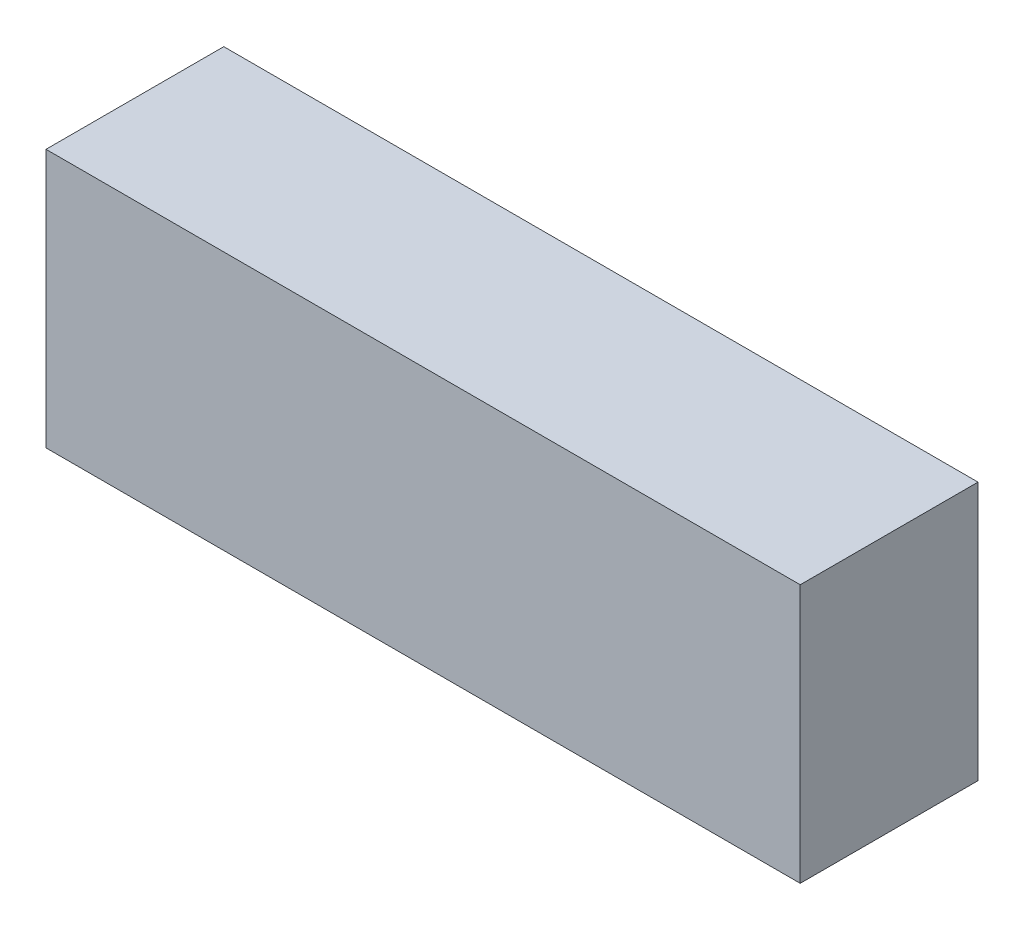
ISO-10303-21;
HEADER;
FILE_DESCRIPTION(('STEP AP214'),'2;1');
FILE_NAME('part.step','',(''),(''),'','','');
FILE_SCHEMA(('AUTOMOTIVE_DESIGN { 1 0 10303 214 1 1 1 1 }'));
ENDSEC;
DATA;
#1=APPLICATION_CONTEXT('core data for automotive mechanical design processes');
#2=APPLICATION_PROTOCOL_DEFINITION('international standard','automotive_design',2000,#1);
#3=PRODUCT_CONTEXT('',#1,'mechanical');
#4=PRODUCT('Part','Part','',(#3));
#5=PRODUCT_RELATED_PRODUCT_CATEGORY('part','',(#4));
#6=PRODUCT_DEFINITION_FORMATION('','',#4);
#7=PRODUCT_DEFINITION_CONTEXT('part definition',#1,'design');
#8=PRODUCT_DEFINITION('design','',#6,#7);
#9=PRODUCT_DEFINITION_SHAPE('','',#8);
#10=(LENGTH_UNIT() NAMED_UNIT(*) SI_UNIT(.MILLI.,.METRE.));
#11=(NAMED_UNIT(*) PLANE_ANGLE_UNIT() SI_UNIT($,.RADIAN.));
#12=(NAMED_UNIT(*) SI_UNIT($,.STERADIAN.) SOLID_ANGLE_UNIT());
#13=UNCERTAINTY_MEASURE_WITH_UNIT(LENGTH_MEASURE(1.E-05),#10,'distance_accuracy_value','');
#14=(GEOMETRIC_REPRESENTATION_CONTEXT(3) GLOBAL_UNCERTAINTY_ASSIGNED_CONTEXT((#13)) GLOBAL_UNIT_ASSIGNED_CONTEXT((#10,
#11,#12)) REPRESENTATION_CONTEXT('',''));
#15=CARTESIAN_POINT('',(0.,0.,0.));
#16=DIRECTION('',(0.,0.,1.));
#17=DIRECTION('',(1.,0.,0.));
#18=AXIS2_PLACEMENT_3D('',#15,#16,#17);
#19=CARTESIAN_POINT('',(44.45,15.24,20.955));
#20=DIRECTION('',(-1.,0.,0.));
#21=DIRECTION('',(0.,-1.,0.));
#22=AXIS2_PLACEMENT_3D('',#19,#20,#21);
#23=PLANE('',#22);
#24=DIRECTION('',(0.,1.,0.));
#25=VECTOR('',#24,1.);
#26=CARTESIAN_POINT('',(44.45,15.24,0.));
#27=LINE('',#26,#25);
#28=CARTESIAN_POINT('',(44.45,-15.24,0.));
#29=VERTEX_POINT('',#28);
#30=CARTESIAN_POINT('',(44.45,15.24,0.));
#31=VERTEX_POINT('',#30);
#32=EDGE_CURVE('E102',#29,#31,#27,.T.);
#33=ORIENTED_EDGE('',*,*,#32,.T.);
#34=DIRECTION('',(0.,0.,-1.));
#35=VECTOR('',#34,1.);
#36=CARTESIAN_POINT('',(44.45,15.24,20.955));
#37=LINE('',#36,#35);
#38=CARTESIAN_POINT('',(44.45,15.24,20.955));
#39=VERTEX_POINT('',#38);
#40=EDGE_CURVE('E11',#39,#31,#37,.T.);
#41=ORIENTED_EDGE('',*,*,#40,.F.);
#42=DIRECTION('',(0.,1.,0.));
#43=VECTOR('',#42,1.);
#44=CARTESIAN_POINT('',(44.45,15.24,20.955));
#45=LINE('',#44,#43);
#46=CARTESIAN_POINT('',(44.45,-15.24,20.955));
#47=VERTEX_POINT('',#46);
#48=EDGE_CURVE('E90',#47,#39,#45,.T.);
#49=ORIENTED_EDGE('',*,*,#48,.F.);
#50=DIRECTION('',(0.,0.,-1.));
#51=VECTOR('',#50,1.);
#52=CARTESIAN_POINT('',(44.45,-15.24,20.955));
#53=LINE('',#52,#51);
#54=EDGE_CURVE('E98',#47,#29,#53,.T.);
#55=ORIENTED_EDGE('',*,*,#54,.T.);
#56=EDGE_LOOP('',(#33,#41,#49,#55));
#57=FACE_BOUND('',#56,.T.);
#58=ADVANCED_FACE('F39',(#57),#23,.F.);
#59=CARTESIAN_POINT('',(-44.45,15.24,20.955));
#60=DIRECTION('',(0.,-1.,0.));
#61=DIRECTION('',(0.,0.,-1.));
#62=AXIS2_PLACEMENT_3D('',#59,#60,#61);
#63=PLANE('',#62);
#64=DIRECTION('',(-1.,0.,0.));
#65=VECTOR('',#64,1.);
#66=CARTESIAN_POINT('',(-44.45,15.24,0.));
#67=LINE('',#66,#65);
#68=CARTESIAN_POINT('',(-44.45,15.24,0.));
#69=VERTEX_POINT('',#68);
#70=EDGE_CURVE('E94',#31,#69,#67,.T.);
#71=ORIENTED_EDGE('',*,*,#70,.T.);
#72=DIRECTION('',(0.,0.,-1.));
#73=VECTOR('',#72,1.);
#74=CARTESIAN_POINT('',(-44.45,15.24,20.955));
#75=LINE('',#74,#73);
#76=CARTESIAN_POINT('',(-44.45,15.24,20.955));
#77=VERTEX_POINT('',#76);
#78=EDGE_CURVE('E47',#77,#69,#75,.T.);
#79=ORIENTED_EDGE('',*,*,#78,.F.);
#80=DIRECTION('',(-1.,0.,0.));
#81=VECTOR('',#80,1.);
#82=CARTESIAN_POINT('',(-44.45,15.24,20.955));
#83=LINE('',#82,#81);
#84=EDGE_CURVE('E85',#39,#77,#83,.T.);
#85=ORIENTED_EDGE('',*,*,#84,.F.);
#86=ORIENTED_EDGE('',*,*,#40,.T.);
#87=EDGE_LOOP('',(#71,#79,#85,#86));
#88=FACE_BOUND('',#87,.T.);
#89=ADVANCED_FACE('F93',(#88),#63,.F.);
#90=CARTESIAN_POINT('',(-44.45,15.24,20.955));
#91=DIRECTION('',(1.,0.,0.));
#92=DIRECTION('',(0.,1.,0.));
#93=AXIS2_PLACEMENT_3D('',#90,#91,#92);
#94=PLANE('',#93);
#95=DIRECTION('',(0.,-1.,0.));
#96=VECTOR('',#95,1.);
#97=CARTESIAN_POINT('',(-44.45,15.24,0.));
#98=LINE('',#97,#96);
#99=CARTESIAN_POINT('',(-44.45,-15.24,0.));
#100=VERTEX_POINT('',#99);
#101=EDGE_CURVE('E72',#69,#100,#98,.T.);
#102=ORIENTED_EDGE('',*,*,#101,.T.);
#103=DIRECTION('',(0.,0.,-1.));
#104=VECTOR('',#103,1.);
#105=CARTESIAN_POINT('',(-44.45,-15.24,20.955));
#106=LINE('',#105,#104);
#107=CARTESIAN_POINT('',(-44.45,-15.24,20.955));
#108=VERTEX_POINT('',#107);
#109=EDGE_CURVE('E95',#108,#100,#106,.T.);
#110=ORIENTED_EDGE('',*,*,#109,.F.);
#111=DIRECTION('',(0.,-1.,0.));
#112=VECTOR('',#111,1.);
#113=CARTESIAN_POINT('',(-44.45,15.24,20.955));
#114=LINE('',#113,#112);
#115=EDGE_CURVE('E88',#77,#108,#114,.T.);
#116=ORIENTED_EDGE('',*,*,#115,.F.);
#117=ORIENTED_EDGE('',*,*,#78,.T.);
#118=EDGE_LOOP('',(#102,#110,#116,#117));
#119=FACE_BOUND('',#118,.T.);
#120=ADVANCED_FACE('F96',(#119),#94,.F.);
#121=CARTESIAN_POINT('',(-44.45,-15.24,20.955));
#122=DIRECTION('',(0.,1.,0.));
#123=DIRECTION('',(0.,0.,1.));
#124=AXIS2_PLACEMENT_3D('',#121,#122,#123);
#125=PLANE('',#124);
#126=DIRECTION('',(1.,0.,0.));
#127=VECTOR('',#126,1.);
#128=CARTESIAN_POINT('',(-44.45,-15.24,0.));
#129=LINE('',#128,#127);
#130=EDGE_CURVE('E78',#100,#29,#129,.T.);
#131=ORIENTED_EDGE('',*,*,#130,.T.);
#132=ORIENTED_EDGE('',*,*,#54,.F.);
#133=DIRECTION('',(1.,0.,0.));
#134=VECTOR('',#133,1.);
#135=CARTESIAN_POINT('',(-44.45,-15.24,20.955));
#136=LINE('',#135,#134);
#137=EDGE_CURVE('E55',#108,#47,#136,.T.);
#138=ORIENTED_EDGE('',*,*,#137,.F.);
#139=ORIENTED_EDGE('',*,*,#109,.T.);
#140=EDGE_LOOP('',(#131,#132,#138,#139));
#141=FACE_BOUND('',#140,.T.);
#142=ADVANCED_FACE('F109',(#141),#125,.F.);
#143=CARTESIAN_POINT('',(0.,0.,20.955));
#144=DIRECTION('',(0.,0.,1.));
#145=DIRECTION('',(1.,0.,0.));
#146=AXIS2_PLACEMENT_3D('',#143,#144,#145);
#147=PLANE('',#146);
#148=ORIENTED_EDGE('',*,*,#48,.T.);
#149=ORIENTED_EDGE('',*,*,#84,.T.);
#150=ORIENTED_EDGE('',*,*,#115,.T.);
#151=ORIENTED_EDGE('',*,*,#137,.T.);
#152=EDGE_LOOP('',(#148,#149,#150,#151));
#153=FACE_BOUND('',#152,.T.);
#154=ADVANCED_FACE('F86',(#153),#147,.T.);
#155=CARTESIAN_POINT('',(0.,0.,0.));
#156=DIRECTION('',(0.,0.,1.));
#157=DIRECTION('',(1.,0.,0.));
#158=AXIS2_PLACEMENT_3D('',#155,#156,#157);
#159=PLANE('',#158);
#160=ORIENTED_EDGE('',*,*,#32,.F.);
#161=ORIENTED_EDGE('',*,*,#130,.F.);
#162=ORIENTED_EDGE('',*,*,#101,.F.);
#163=ORIENTED_EDGE('',*,*,#70,.F.);
#164=EDGE_LOOP('',(#160,#161,#162,#163));
#165=FACE_BOUND('',#164,.T.);
#166=ADVANCED_FACE('F112',(#165),#159,.F.);
#167=CLOSED_SHELL('',(#58,#89,#120,#142,#154,#166));
#168=MANIFOLD_SOLID_BREP('B2',#167);
#169=ADVANCED_BREP_SHAPE_REPRESENTATION('',(#18,#168),#14);
#170=SHAPE_DEFINITION_REPRESENTATION(#9,#169);
ENDSEC;
END-ISO-10303-21;
